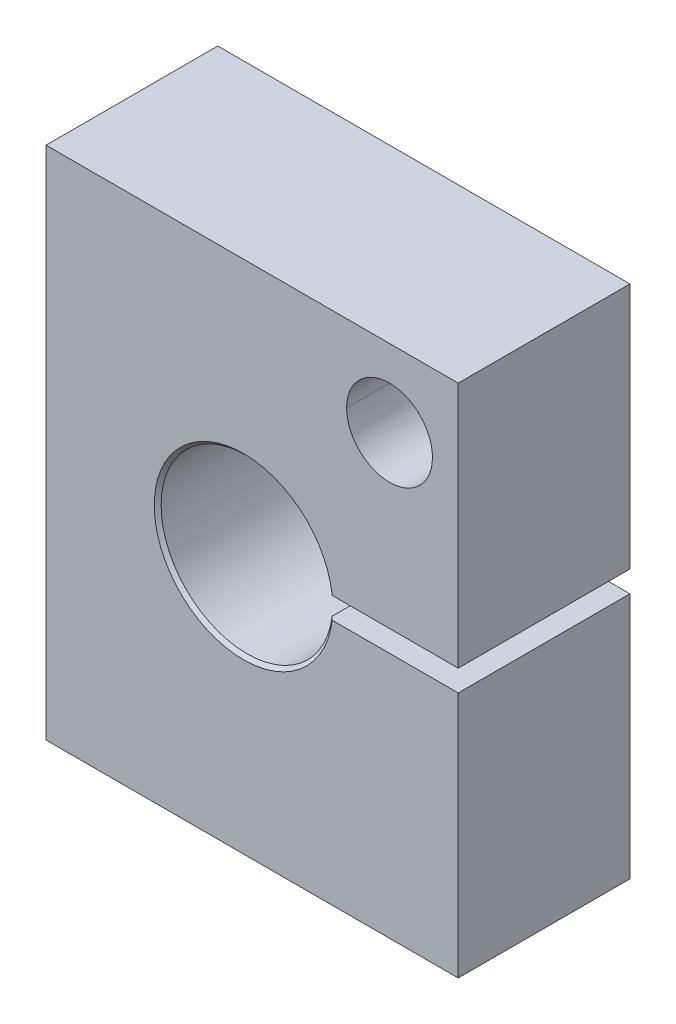
ISO-10303-21;
HEADER;
FILE_DESCRIPTION(('STEP AP214'),'2;1');
FILE_NAME('part.step','',(''),(''),'','','');
FILE_SCHEMA(('AUTOMOTIVE_DESIGN { 1 0 10303 214 1 1 1 1 }'));
ENDSEC;
DATA;
#1=APPLICATION_CONTEXT('core data for automotive mechanical design processes');
#2=APPLICATION_PROTOCOL_DEFINITION('international standard','automotive_design',2000,#1);
#3=PRODUCT_CONTEXT('',#1,'mechanical');
#4=PRODUCT('Part','Part','',(#3));
#5=PRODUCT_RELATED_PRODUCT_CATEGORY('part','',(#4));
#6=PRODUCT_DEFINITION_FORMATION('','',#4);
#7=PRODUCT_DEFINITION_CONTEXT('part definition',#1,'design');
#8=PRODUCT_DEFINITION('design','',#6,#7);
#9=PRODUCT_DEFINITION_SHAPE('','',#8);
#10=(LENGTH_UNIT() NAMED_UNIT(*) SI_UNIT(.MILLI.,.METRE.));
#11=(NAMED_UNIT(*) PLANE_ANGLE_UNIT() SI_UNIT($,.RADIAN.));
#12=(NAMED_UNIT(*) SI_UNIT($,.STERADIAN.) SOLID_ANGLE_UNIT());
#13=UNCERTAINTY_MEASURE_WITH_UNIT(LENGTH_MEASURE(1.E-05),#10,'distance_accuracy_value','');
#14=(GEOMETRIC_REPRESENTATION_CONTEXT(3) GLOBAL_UNCERTAINTY_ASSIGNED_CONTEXT((#13)) GLOBAL_UNIT_ASSIGNED_CONTEXT((#10,
#11,#12)) REPRESENTATION_CONTEXT('',''));
#15=CARTESIAN_POINT('',(0.,0.,0.));
#16=DIRECTION('',(0.,0.,1.));
#17=DIRECTION('',(1.,0.,0.));
#18=AXIS2_PLACEMENT_3D('',#15,#16,#17);
#19=CARTESIAN_POINT('',(10.16,13.335,-6.35));
#20=DIRECTION('',(0.,0.,1.));
#21=DIRECTION('',(1.,0.,0.));
#22=AXIS2_PLACEMENT_3D('',#19,#20,#21);
#23=CYLINDRICAL_SURFACE('',#22,3.175);
#24=CARTESIAN_POINT('',(10.16,13.335,-6.35));
#25=DIRECTION('',(0.,0.,1.));
#26=DIRECTION('',(1.,0.,0.));
#27=AXIS2_PLACEMENT_3D('',#24,#25,#26);
#28=CIRCLE('',#27,3.175);
#29=CARTESIAN_POINT('',(6.985,13.335,-6.35));
#30=VERTEX_POINT('',#29);
#31=CARTESIAN_POINT('',(13.335,13.335,-6.35));
#32=VERTEX_POINT('',#31);
#33=EDGE_CURVE('E445',#30,#32,#28,.T.);
#34=ORIENTED_EDGE('',*,*,#33,.F.);
#35=DIRECTION('',(0.,0.,1.));
#36=VECTOR('',#35,1.);
#37=CARTESIAN_POINT('',(6.985,13.335,-6.35));
#38=LINE('',#37,#36);
#39=CARTESIAN_POINT('',(6.985,13.335,6.35));
#40=VERTEX_POINT('',#39);
#41=EDGE_CURVE('E11',#30,#40,#38,.T.);
#42=ORIENTED_EDGE('',*,*,#41,.T.);
#43=CARTESIAN_POINT('',(10.16,13.335,6.35));
#44=DIRECTION('',(0.,0.,1.));
#45=DIRECTION('',(1.,0.,0.));
#46=AXIS2_PLACEMENT_3D('',#43,#44,#45);
#47=CIRCLE('',#46,3.175);
#48=CARTESIAN_POINT('',(13.335,13.335,6.35));
#49=VERTEX_POINT('',#48);
#50=EDGE_CURVE('E446',#40,#49,#47,.T.);
#51=ORIENTED_EDGE('',*,*,#50,.T.);
#52=DIRECTION('',(0.,0.,-1.));
#53=VECTOR('',#52,1.);
#54=CARTESIAN_POINT('',(13.335,13.335,-6.35));
#55=LINE('',#54,#53);
#56=EDGE_CURVE('E48',#49,#32,#55,.T.);
#57=ORIENTED_EDGE('',*,*,#56,.T.);
#58=EDGE_LOOP('',(#34,#42,#51,#57));
#59=FACE_BOUND('',#58,.T.);
#60=ADVANCED_FACE('F38',(#59),#23,.F.);
#61=CARTESIAN_POINT('',(-15.24,-19.05,6.35));
#62=DIRECTION('',(0.,1.,0.));
#63=DIRECTION('',(0.,0.,1.));
#64=AXIS2_PLACEMENT_3D('',#61,#62,#63);
#65=PLANE('',#64);
#66=CARTESIAN_POINT('',(-8.89,-19.05,0.));
#67=DIRECTION('',(0.,-1.,0.));
#68=DIRECTION('',(0.,0.,-1.));
#69=AXIS2_PLACEMENT_3D('',#66,#67,#68);
#70=CIRCLE('',#69,3.175);
#71=CARTESIAN_POINT('',(-8.89,-19.05,-3.175));
#72=VERTEX_POINT('',#71);
#73=EDGE_CURVE('E140',#72,#72,#70,.T.);
#74=ORIENTED_EDGE('',*,*,#73,.F.);
#75=EDGE_LOOP('',(#74));
#76=FACE_BOUND('',#75,.T.);
#77=DIRECTION('',(1.,0.,0.));
#78=VECTOR('',#77,1.);
#79=CARTESIAN_POINT('',(-15.24,-19.05,-6.35));
#80=LINE('',#79,#78);
#81=CARTESIAN_POINT('',(-15.24,-19.05,-6.35));
#82=VERTEX_POINT('',#81);
#83=CARTESIAN_POINT('',(15.24,-19.05,-6.35));
#84=VERTEX_POINT('',#83);
#85=EDGE_CURVE('E188',#82,#84,#80,.T.);
#86=ORIENTED_EDGE('',*,*,#85,.T.);
#87=DIRECTION('',(0.,0.,-1.));
#88=VECTOR('',#87,1.);
#89=CARTESIAN_POINT('',(15.24,-19.05,6.35));
#90=LINE('',#89,#88);
#91=CARTESIAN_POINT('',(15.24,-19.05,6.35));
#92=VERTEX_POINT('',#91);
#93=EDGE_CURVE('E180',#92,#84,#90,.T.);
#94=ORIENTED_EDGE('',*,*,#93,.F.);
#95=DIRECTION('',(1.,0.,0.));
#96=VECTOR('',#95,1.);
#97=CARTESIAN_POINT('',(-15.24,-19.05,6.35));
#98=LINE('',#97,#96);
#99=CARTESIAN_POINT('',(-15.24,-19.05,6.35));
#100=VERTEX_POINT('',#99);
#101=EDGE_CURVE('E178',#100,#92,#98,.T.);
#102=ORIENTED_EDGE('',*,*,#101,.F.);
#103=DIRECTION('',(0.,0.,-1.));
#104=VECTOR('',#103,1.);
#105=CARTESIAN_POINT('',(-15.24,-19.05,6.35));
#106=LINE('',#105,#104);
#107=EDGE_CURVE('E192',#100,#82,#106,.T.);
#108=ORIENTED_EDGE('',*,*,#107,.T.);
#109=EDGE_LOOP('',(#86,#94,#102,#108));
#110=FACE_BOUND('',#109,.T.);
#111=CARTESIAN_POINT('',(8.89,-19.05,0.));
#112=DIRECTION('',(0.,-1.,0.));
#113=DIRECTION('',(0.,0.,-1.));
#114=AXIS2_PLACEMENT_3D('',#111,#112,#113);
#115=CIRCLE('',#114,3.175);
#116=CARTESIAN_POINT('',(8.89,-19.05,-3.175));
#117=VERTEX_POINT('',#116);
#118=EDGE_CURVE('E139',#117,#117,#115,.T.);
#119=ORIENTED_EDGE('',*,*,#118,.F.);
#120=EDGE_LOOP('',(#119));
#121=FACE_BOUND('',#120,.T.);
#122=ADVANCED_FACE('F279',(#76,#110,#121),#65,.F.);
#123=CARTESIAN_POINT('',(15.24,19.05,6.35));
#124=DIRECTION('',(-1.,0.,0.));
#125=DIRECTION('',(0.,-1.,0.));
#126=AXIS2_PLACEMENT_3D('',#123,#124,#125);
#127=PLANE('',#126);
#128=DIRECTION('',(0.,1.,0.));
#129=VECTOR('',#128,1.);
#130=CARTESIAN_POINT('',(15.24,19.05,6.35));
#131=LINE('',#130,#129);
#132=CARTESIAN_POINT('',(15.24,0.793749999999996,6.35));
#133=VERTEX_POINT('',#132);
#134=CARTESIAN_POINT('',(15.24,19.05,6.35));
#135=VERTEX_POINT('',#134);
#136=EDGE_CURVE('E174',#133,#135,#131,.T.);
#137=ORIENTED_EDGE('',*,*,#136,.F.);
#138=DIRECTION('',(0.,0.,-1.));
#139=VECTOR('',#138,1.);
#140=CARTESIAN_POINT('',(15.24,0.793749999999996,6.35));
#141=LINE('',#140,#139);
#142=CARTESIAN_POINT('',(15.24,0.793749999999996,-6.35));
#143=VERTEX_POINT('',#142);
#144=EDGE_CURVE('E159',#133,#143,#141,.T.);
#145=ORIENTED_EDGE('',*,*,#144,.T.);
#146=DIRECTION('',(0.,1.,0.));
#147=VECTOR('',#146,1.);
#148=CARTESIAN_POINT('',(15.24,19.05,-6.35));
#149=LINE('',#148,#147);
#150=CARTESIAN_POINT('',(15.24,19.05,-6.35));
#151=VERTEX_POINT('',#150);
#152=EDGE_CURVE('E169',#143,#151,#149,.T.);
#153=ORIENTED_EDGE('',*,*,#152,.T.);
#154=DIRECTION('',(0.,0.,-1.));
#155=VECTOR('',#154,1.);
#156=CARTESIAN_POINT('',(15.24,19.05,6.35));
#157=LINE('',#156,#155);
#158=EDGE_CURVE('E198',#135,#151,#157,.T.);
#159=ORIENTED_EDGE('',*,*,#158,.F.);
#160=EDGE_LOOP('',(#137,#145,#153,#159));
#161=FACE_BOUND('',#160,.T.);
#162=ADVANCED_FACE('F270',(#161),#127,.F.);
#163=CARTESIAN_POINT('',(15.24,-0.793749999999996,-6.35));
#164=VERTEX_POINT('',#163);
#165=EDGE_CURVE('E181',#84,#164,#149,.T.);
#166=ORIENTED_EDGE('',*,*,#165,.T.);
#167=DIRECTION('',(0.,0.,-1.));
#168=VECTOR('',#167,1.);
#169=CARTESIAN_POINT('',(15.24,-0.793750000000003,6.35));
#170=LINE('',#169,#168);
#171=CARTESIAN_POINT('',(15.24,-0.793750000000003,6.35));
#172=VERTEX_POINT('',#171);
#173=EDGE_CURVE('E152',#172,#164,#170,.T.);
#174=ORIENTED_EDGE('',*,*,#173,.F.);
#175=EDGE_CURVE('E170',#92,#172,#131,.T.);
#176=ORIENTED_EDGE('',*,*,#175,.F.);
#177=ORIENTED_EDGE('',*,*,#93,.T.);
#178=EDGE_LOOP('',(#166,#174,#176,#177));
#179=FACE_BOUND('',#178,.T.);
#180=ADVANCED_FACE('F265',(#179),#127,.F.);
#181=CARTESIAN_POINT('',(-15.24,19.05,6.35));
#182=DIRECTION('',(0.,-1.,0.));
#183=DIRECTION('',(0.,0.,-1.));
#184=AXIS2_PLACEMENT_3D('',#181,#182,#183);
#185=PLANE('',#184);
#186=DIRECTION('',(-1.,0.,0.));
#187=VECTOR('',#186,1.);
#188=CARTESIAN_POINT('',(-15.24,19.05,-6.35));
#189=LINE('',#188,#187);
#190=CARTESIAN_POINT('',(-15.24,19.05,-6.35));
#191=VERTEX_POINT('',#190);
#192=EDGE_CURVE('E184',#151,#191,#189,.T.);
#193=ORIENTED_EDGE('',*,*,#192,.T.);
#194=DIRECTION('',(0.,0.,-1.));
#195=VECTOR('',#194,1.);
#196=CARTESIAN_POINT('',(-15.24,19.05,6.35));
#197=LINE('',#196,#195);
#198=CARTESIAN_POINT('',(-15.24,19.05,6.35));
#199=VERTEX_POINT('',#198);
#200=EDGE_CURVE('E195',#199,#191,#197,.T.);
#201=ORIENTED_EDGE('',*,*,#200,.F.);
#202=DIRECTION('',(-1.,0.,0.));
#203=VECTOR('',#202,1.);
#204=CARTESIAN_POINT('',(-15.24,19.05,6.35));
#205=LINE('',#204,#203);
#206=EDGE_CURVE('E173',#135,#199,#205,.T.);
#207=ORIENTED_EDGE('',*,*,#206,.F.);
#208=ORIENTED_EDGE('',*,*,#158,.T.);
#209=EDGE_LOOP('',(#193,#201,#207,#208));
#210=FACE_BOUND('',#209,.T.);
#211=ADVANCED_FACE('F269',(#210),#185,.F.);
#212=CARTESIAN_POINT('',(-15.24,19.05,6.35));
#213=DIRECTION('',(1.,0.,0.));
#214=DIRECTION('',(0.,1.,0.));
#215=AXIS2_PLACEMENT_3D('',#212,#213,#214);
#216=PLANE('',#215);
#217=DIRECTION('',(0.,-1.,0.));
#218=VECTOR('',#217,1.);
#219=CARTESIAN_POINT('',(-15.24,19.05,-6.35));
#220=LINE('',#219,#218);
#221=EDGE_CURVE('E186',#191,#82,#220,.T.);
#222=ORIENTED_EDGE('',*,*,#221,.T.);
#223=ORIENTED_EDGE('',*,*,#107,.F.);
#224=DIRECTION('',(0.,-1.,0.));
#225=VECTOR('',#224,1.);
#226=CARTESIAN_POINT('',(-15.24,19.05,6.35));
#227=LINE('',#226,#225);
#228=EDGE_CURVE('E176',#199,#100,#227,.T.);
#229=ORIENTED_EDGE('',*,*,#228,.F.);
#230=ORIENTED_EDGE('',*,*,#200,.T.);
#231=EDGE_LOOP('',(#222,#223,#229,#230));
#232=FACE_BOUND('',#231,.T.);
#233=ADVANCED_FACE('F274',(#232),#216,.F.);
#234=CARTESIAN_POINT('',(0.,0.,6.35));
#235=DIRECTION('',(0.,0.,1.));
#236=DIRECTION('',(1.,0.,0.));
#237=AXIS2_PLACEMENT_3D('',#234,#235,#236);
#238=PLANE('',#237);
#239=EDGE_CURVE('E449',#49,#40,#47,.T.);
#240=ORIENTED_EDGE('',*,*,#239,.F.);
#241=ORIENTED_EDGE('',*,*,#50,.F.);
#242=EDGE_LOOP('',(#240,#241));
#243=FACE_BOUND('',#242,.T.);
#244=DIRECTION('',(-1.,0.,0.));
#245=VECTOR('',#244,1.);
#246=CARTESIAN_POINT('',(15.24,-0.793750000000003,6.35));
#247=LINE('',#246,#245);
#248=CARTESIAN_POINT('',(5.92112514657092,-0.793750000000003,6.35));
#249=VERTEX_POINT('',#248);
#250=EDGE_CURVE('E153',#172,#249,#247,.T.);
#251=ORIENTED_EDGE('',*,*,#250,.T.);
#252=CARTESIAN_POINT('',(-0.635,0.,6.35));
#253=DIRECTION('',(0.,0.,1.));
#254=DIRECTION('',(1.,0.,0.));
#255=AXIS2_PLACEMENT_3D('',#252,#253,#254);
#256=CIRCLE('',#255,6.60399999999997);
#257=CARTESIAN_POINT('',(5.92112514657092,0.793749999999995,6.35));
#258=VERTEX_POINT('',#257);
#259=EDGE_CURVE('E258',#249,#258,#256,.F.);
#260=ORIENTED_EDGE('',*,*,#259,.T.);
#261=DIRECTION('',(1.,0.,0.));
#262=VECTOR('',#261,1.);
#263=CARTESIAN_POINT('',(15.24,0.793749999999996,6.35));
#264=LINE('',#263,#262);
#265=EDGE_CURVE('E157',#258,#133,#264,.T.);
#266=ORIENTED_EDGE('',*,*,#265,.T.);
#267=ORIENTED_EDGE('',*,*,#136,.T.);
#268=ORIENTED_EDGE('',*,*,#206,.T.);
#269=ORIENTED_EDGE('',*,*,#228,.T.);
#270=ORIENTED_EDGE('',*,*,#101,.T.);
#271=ORIENTED_EDGE('',*,*,#175,.T.);
#272=EDGE_LOOP('',(#251,#260,#266,#267,#268,#269,#270,#271));
#273=FACE_BOUND('',#272,.T.);
#274=ADVANCED_FACE('F241',(#243,#273),#238,.T.);
#275=CARTESIAN_POINT('',(0.,0.,-6.35));
#276=DIRECTION('',(0.,0.,1.));
#277=DIRECTION('',(1.,0.,0.));
#278=AXIS2_PLACEMENT_3D('',#275,#276,#277);
#279=PLANE('',#278);
#280=EDGE_CURVE('E146',#32,#30,#28,.T.);
#281=ORIENTED_EDGE('',*,*,#280,.T.);
#282=ORIENTED_EDGE('',*,*,#33,.T.);
#283=EDGE_LOOP('',(#281,#282));
#284=FACE_BOUND('',#283,.T.);
#285=DIRECTION('',(-1.,0.,0.));
#286=VECTOR('',#285,1.);
#287=CARTESIAN_POINT('',(0.,0.793749999999994,-6.35));
#288=LINE('',#287,#286);
#289=CARTESIAN_POINT('',(5.92112514657092,0.793749999999995,-6.35));
#290=VERTEX_POINT('',#289);
#291=EDGE_CURVE('E203',#143,#290,#288,.T.);
#292=ORIENTED_EDGE('',*,*,#291,.T.);
#293=CARTESIAN_POINT('',(-0.635,0.,-6.35));
#294=DIRECTION('',(0.,0.,1.));
#295=DIRECTION('',(1.,0.,0.));
#296=AXIS2_PLACEMENT_3D('',#293,#294,#295);
#297=CIRCLE('',#296,6.60399999999997);
#298=CARTESIAN_POINT('',(5.92112514657092,-0.793750000000003,-6.35));
#299=VERTEX_POINT('',#298);
#300=EDGE_CURVE('E206',#290,#299,#297,.T.);
#301=ORIENTED_EDGE('',*,*,#300,.T.);
#302=DIRECTION('',(1.,0.,0.));
#303=VECTOR('',#302,1.);
#304=CARTESIAN_POINT('',(0.,-0.793750000000003,-6.35));
#305=LINE('',#304,#303);
#306=EDGE_CURVE('E201',#299,#164,#305,.T.);
#307=ORIENTED_EDGE('',*,*,#306,.T.);
#308=ORIENTED_EDGE('',*,*,#165,.F.);
#309=ORIENTED_EDGE('',*,*,#85,.F.);
#310=ORIENTED_EDGE('',*,*,#221,.F.);
#311=ORIENTED_EDGE('',*,*,#192,.F.);
#312=ORIENTED_EDGE('',*,*,#152,.F.);
#313=EDGE_LOOP('',(#292,#301,#307,#308,#309,#310,#311,#312));
#314=FACE_BOUND('',#313,.T.);
#315=ADVANCED_FACE('F239',(#284,#314),#279,.F.);
#316=CARTESIAN_POINT('',(15.24,0.793749999999996,6.35));
#317=DIRECTION('',(0.,1.,0.));
#318=DIRECTION('',(-1.,0.,0.));
#319=AXIS2_PLACEMENT_3D('',#316,#317,#318);
#320=PLANE('',#319);
#321=DIRECTION('',(0.,0.,-1.));
#322=VECTOR('',#321,1.);
#323=CARTESIAN_POINT('',(5.66519530947256,0.793749999999995,6.35));
#324=LINE('',#323,#322);
#325=CARTESIAN_POINT('',(5.66519530947256,0.793749999999995,6.09600000000003));
#326=VERTEX_POINT('',#325);
#327=CARTESIAN_POINT('',(5.66519530947256,0.793749999999995,-6.09600000000003));
#328=VERTEX_POINT('',#327);
#329=EDGE_CURVE('E160',#326,#328,#324,.T.);
#330=ORIENTED_EDGE('',*,*,#329,.T.);
#331=CARTESIAN_POINT('',(5.66519530947256,0.793749999999995,-6.09600000000003));
#332=CARTESIAN_POINT('',(5.70785661276119,0.793749999999995,-6.1383269548065));
#333=CARTESIAN_POINT('',(5.7505147508327,0.793749999999995,-6.18065709887872));
#334=CARTESIAN_POINT('',(5.83582469653216,0.793749999999995,-6.26532376554538));
#335=CARTESIAN_POINT('',(5.8784765041601,0.793749999999995,-6.30766028813982));
#336=CARTESIAN_POINT('',(5.92112514657092,0.793749999999995,-6.35));
#337=B_SPLINE_CURVE_WITH_KNOTS('',3,(#331,#332,#333,#334,#335,#336),.UNSPECIFIED.,.F.,.F.,(4,2,
4),(0.,0.180288714478005,0.360577428916484),.UNSPECIFIED.);
#338=EDGE_CURVE('E252',#328,#290,#337,.T.);
#339=ORIENTED_EDGE('',*,*,#338,.T.);
#340=ORIENTED_EDGE('',*,*,#291,.F.);
#341=ORIENTED_EDGE('',*,*,#144,.F.);
#342=ORIENTED_EDGE('',*,*,#265,.F.);
#343=CARTESIAN_POINT('',(5.92112514657092,0.793749999999995,6.35));
#344=CARTESIAN_POINT('',(5.87847650416009,0.793749999999995,6.30766028813982));
#345=CARTESIAN_POINT('',(5.83582469653216,0.793749999999995,6.26532376554538));
#346=CARTESIAN_POINT('',(5.7505147508327,0.793749999999995,6.18065709887872));
#347=CARTESIAN_POINT('',(5.70785661276119,0.793749999999995,6.1383269548065));
#348=CARTESIAN_POINT('',(5.66519530947256,0.793749999999995,6.09600000000003));
#349=B_SPLINE_CURVE_WITH_KNOTS('',3,(#343,#344,#345,#346,#347,#348),.UNSPECIFIED.,.F.,.F.,(4,2,
4),(0.,0.180288714438479,0.360577428916482),.UNSPECIFIED.);
#350=EDGE_CURVE('E245',#258,#326,#349,.T.);
#351=ORIENTED_EDGE('',*,*,#350,.T.);
#352=EDGE_LOOP('',(#330,#339,#340,#341,#342,#351));
#353=FACE_BOUND('',#352,.T.);
#354=ADVANCED_FACE('F234',(#353),#320,.F.);
#355=CARTESIAN_POINT('',(-0.635,0.,6.35));
#356=DIRECTION('',(0.,0.,-1.));
#357=DIRECTION('',(-1.,0.,0.));
#358=AXIS2_PLACEMENT_3D('',#355,#356,#357);
#359=CYLINDRICAL_SURFACE('',#358,6.35);
#360=DIRECTION('',(0.,0.,-1.));
#361=VECTOR('',#360,1.);
#362=CARTESIAN_POINT('',(5.66519530947256,-0.793750000000006,6.35));
#363=LINE('',#362,#361);
#364=CARTESIAN_POINT('',(5.66519530947256,-0.793750000000006,6.09600000000003));
#365=VERTEX_POINT('',#364);
#366=CARTESIAN_POINT('',(5.66519530947256,-0.793750000000006,-6.09600000000002));
#367=VERTEX_POINT('',#366);
#368=EDGE_CURVE('E156',#365,#367,#363,.T.);
#369=ORIENTED_EDGE('',*,*,#368,.T.);
#370=CARTESIAN_POINT('',(-0.635,0.,-6.09600000000003));
#371=DIRECTION('',(0.,0.,1.));
#372=DIRECTION('',(1.,0.,0.));
#373=AXIS2_PLACEMENT_3D('',#370,#371,#372);
#374=CIRCLE('',#373,6.35);
#375=EDGE_CURVE('E454',#367,#328,#374,.F.);
#376=ORIENTED_EDGE('',*,*,#375,.T.);
#377=ORIENTED_EDGE('',*,*,#329,.F.);
#378=CARTESIAN_POINT('',(-0.635,0.,6.09600000000003));
#379=DIRECTION('',(0.,0.,1.));
#380=DIRECTION('',(1.,0.,0.));
#381=AXIS2_PLACEMENT_3D('',#378,#379,#380);
#382=CIRCLE('',#381,6.35);
#383=EDGE_CURVE('E452',#326,#365,#382,.T.);
#384=ORIENTED_EDGE('',*,*,#383,.T.);
#385=EDGE_LOOP('',(#369,#376,#377,#384));
#386=FACE_BOUND('',#385,.T.);
#387=ADVANCED_FACE('F228',(#386),#359,.F.);
#388=CARTESIAN_POINT('',(15.24,-0.793750000000003,6.35));
#389=DIRECTION('',(0.,-1.,0.));
#390=DIRECTION('',(0.,0.,-1.));
#391=AXIS2_PLACEMENT_3D('',#388,#389,#390);
#392=PLANE('',#391);
#393=ORIENTED_EDGE('',*,*,#306,.F.);
#394=CARTESIAN_POINT('',(5.92112514657092,-0.793750000000003,-6.35));
#395=CARTESIAN_POINT('',(5.8784765041601,-0.793750000000003,-6.30766028813982));
#396=CARTESIAN_POINT('',(5.83582469653216,-0.793750000000003,-6.26532376554538));
#397=CARTESIAN_POINT('',(5.7505147508327,-0.793750000000003,-6.18065709887872));
#398=CARTESIAN_POINT('',(5.70785661276119,-0.793750000000003,-6.1383269548065));
#399=CARTESIAN_POINT('',(5.66519530947256,-0.793750000000003,-6.09600000000003));
#400=B_SPLINE_CURVE_WITH_KNOTS('',3,(#394,#395,#396,#397,#398,#399),.UNSPECIFIED.,.F.,.F.,(4,2,
4),(0.,0.180288714438479,0.360577428916484),.UNSPECIFIED.);
#401=EDGE_CURVE('E216',#299,#367,#400,.T.);
#402=ORIENTED_EDGE('',*,*,#401,.T.);
#403=ORIENTED_EDGE('',*,*,#368,.F.);
#404=CARTESIAN_POINT('',(5.66519530947256,-0.793750000000006,6.09600000000003));
#405=CARTESIAN_POINT('',(5.70785661276119,-0.793750000000004,6.1383269548065));
#406=CARTESIAN_POINT('',(5.7505147508327,-0.793750000000003,6.18065709887872));
#407=CARTESIAN_POINT('',(5.83582469653216,-0.793750000000002,6.26532376554538));
#408=CARTESIAN_POINT('',(5.87847650416009,-0.793750000000002,6.30766028813982));
#409=CARTESIAN_POINT('',(5.92112514657092,-0.793750000000003,6.35));
#410=B_SPLINE_CURVE_WITH_KNOTS('',3,(#404,#405,#406,#407,#408,#409),.UNSPECIFIED.,.F.,.F.,(4,2,
4),(0.,0.180288714478004,0.360577428916482),.UNSPECIFIED.);
#411=EDGE_CURVE('E209',#365,#249,#410,.T.);
#412=ORIENTED_EDGE('',*,*,#411,.T.);
#413=ORIENTED_EDGE('',*,*,#250,.F.);
#414=ORIENTED_EDGE('',*,*,#173,.T.);
#415=EDGE_LOOP('',(#393,#402,#403,#412,#413,#414));
#416=FACE_BOUND('',#415,.T.);
#417=ADVANCED_FACE('F222',(#416),#392,.F.);
#418=CARTESIAN_POINT('',(8.89,-11.43,0.));
#419=DIRECTION('',(0.,-1.,0.));
#420=DIRECTION('',(0.,0.,-1.));
#421=AXIS2_PLACEMENT_3D('',#418,#419,#420);
#422=CONICAL_SURFACE('',#421,3.175,1.02974425867665);
#423=CARTESIAN_POINT('',(8.89,-9.5222675345875,0.));
#424=VERTEX_POINT('',#423);
#425=VERTEX_LOOP('',#424);
#426=FACE_BOUND('',#425,.T.);
#427=CARTESIAN_POINT('',(8.89,-11.43,0.));
#428=DIRECTION('',(0.,-1.,0.));
#429=DIRECTION('',(0.,0.,-1.));
#430=AXIS2_PLACEMENT_3D('',#427,#428,#429);
#431=CIRCLE('',#430,3.175);
#432=CARTESIAN_POINT('',(8.89,-11.43,-3.175));
#433=VERTEX_POINT('',#432);
#434=EDGE_CURVE('E143',#433,#433,#431,.T.);
#435=ORIENTED_EDGE('',*,*,#434,.T.);
#436=EDGE_LOOP('',(#435));
#437=FACE_BOUND('',#436,.T.);
#438=ADVANCED_FACE('F227',(#426,#437),#422,.F.);
#439=CARTESIAN_POINT('',(8.89,-19.05,0.));
#440=DIRECTION('',(0.,-1.,0.));
#441=DIRECTION('',(0.,0.,-1.));
#442=AXIS2_PLACEMENT_3D('',#439,#440,#441);
#443=CYLINDRICAL_SURFACE('',#442,3.175);
#444=ORIENTED_EDGE('',*,*,#434,.F.);
#445=EDGE_LOOP('',(#444));
#446=FACE_BOUND('',#445,.T.);
#447=ORIENTED_EDGE('',*,*,#118,.T.);
#448=EDGE_LOOP('',(#447));
#449=FACE_BOUND('',#448,.T.);
#450=ADVANCED_FACE('F263',(#446,#449),#443,.F.);
#451=CARTESIAN_POINT('',(-0.635,0.,-6.35));
#452=DIRECTION('',(0.,0.,-1.));
#453=DIRECTION('',(-1.,0.,0.));
#454=AXIS2_PLACEMENT_3D('',#451,#452,#453);
#455=CONICAL_SURFACE('',#454,6.60399999999997,0.785398163397447);
#456=ORIENTED_EDGE('',*,*,#338,.F.);
#457=ORIENTED_EDGE('',*,*,#375,.F.);
#458=ORIENTED_EDGE('',*,*,#401,.F.);
#459=ORIENTED_EDGE('',*,*,#300,.F.);
#460=EDGE_LOOP('',(#456,#457,#458,#459));
#461=FACE_BOUND('',#460,.T.);
#462=ADVANCED_FACE('F259',(#461),#455,.F.);
#463=CARTESIAN_POINT('',(-0.635,0.,6.35));
#464=DIRECTION('',(0.,0.,1.));
#465=DIRECTION('',(1.,0.,0.));
#466=AXIS2_PLACEMENT_3D('',#463,#464,#465);
#467=CONICAL_SURFACE('',#466,6.60399999999997,0.785398163397447);
#468=ORIENTED_EDGE('',*,*,#411,.F.);
#469=ORIENTED_EDGE('',*,*,#383,.F.);
#470=ORIENTED_EDGE('',*,*,#350,.F.);
#471=ORIENTED_EDGE('',*,*,#259,.F.);
#472=EDGE_LOOP('',(#468,#469,#470,#471));
#473=FACE_BOUND('',#472,.T.);
#474=ADVANCED_FACE('F40',(#473),#467,.F.);
#475=CARTESIAN_POINT('',(-8.89,-11.43,0.));
#476=DIRECTION('',(0.,-1.,0.));
#477=DIRECTION('',(0.,0.,-1.));
#478=AXIS2_PLACEMENT_3D('',#475,#476,#477);
#479=CONICAL_SURFACE('',#478,3.175,1.02974425867665);
#480=CARTESIAN_POINT('',(-8.89,-9.5222675345875,0.));
#481=VERTEX_POINT('',#480);
#482=VERTEX_LOOP('',#481);
#483=FACE_BOUND('',#482,.T.);
#484=CARTESIAN_POINT('',(-8.89,-11.43,0.));
#485=DIRECTION('',(0.,-1.,0.));
#486=DIRECTION('',(0.,0.,-1.));
#487=AXIS2_PLACEMENT_3D('',#484,#485,#486);
#488=CIRCLE('',#487,3.175);
#489=CARTESIAN_POINT('',(-8.89,-11.43,-3.175));
#490=VERTEX_POINT('',#489);
#491=EDGE_CURVE('E137',#490,#490,#488,.T.);
#492=ORIENTED_EDGE('',*,*,#491,.T.);
#493=EDGE_LOOP('',(#492));
#494=FACE_BOUND('',#493,.T.);
#495=ADVANCED_FACE('F130',(#483,#494),#479,.F.);
#496=CARTESIAN_POINT('',(-8.89,-19.05,0.));
#497=DIRECTION('',(0.,-1.,0.));
#498=DIRECTION('',(0.,0.,-1.));
#499=AXIS2_PLACEMENT_3D('',#496,#497,#498);
#500=CYLINDRICAL_SURFACE('',#499,3.175);
#501=ORIENTED_EDGE('',*,*,#491,.F.);
#502=EDGE_LOOP('',(#501));
#503=FACE_BOUND('',#502,.T.);
#504=ORIENTED_EDGE('',*,*,#73,.T.);
#505=EDGE_LOOP('',(#504));
#506=FACE_BOUND('',#505,.T.);
#507=ADVANCED_FACE('F133',(#503,#506),#500,.F.);
#508=ORIENTED_EDGE('',*,*,#41,.F.);
#509=ORIENTED_EDGE('',*,*,#280,.F.);
#510=ORIENTED_EDGE('',*,*,#56,.F.);
#511=ORIENTED_EDGE('',*,*,#239,.T.);
#512=EDGE_LOOP('',(#508,#509,#510,#511));
#513=FACE_BOUND('',#512,.T.);
#514=ADVANCED_FACE('F292',(#513),#23,.F.);
#515=CLOSED_SHELL('',(#60,#122,#162,#180,#211,#233,#274,#315,#354,#387,#417,#438,#450,#462,#474,
#495,#507,#514));
#516=MANIFOLD_SOLID_BREP('B2',#515);
#517=ADVANCED_BREP_SHAPE_REPRESENTATION('',(#18,#516),#14);
#518=SHAPE_DEFINITION_REPRESENTATION(#9,#517);
ENDSEC;
END-ISO-10303-21;
